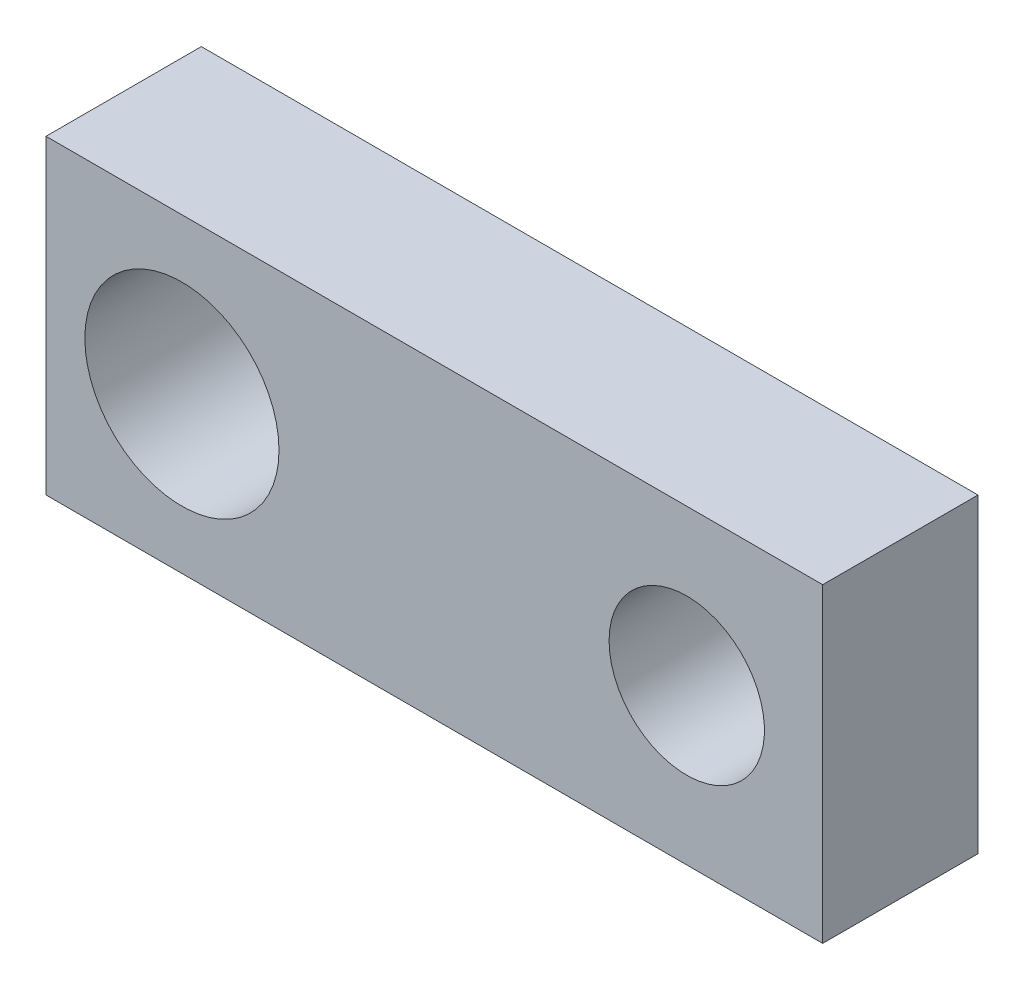
ISO-10303-21;
HEADER;
FILE_DESCRIPTION(('STEP AP214'),'2;1');
FILE_NAME('part.step','',(''),(''),'','','');
FILE_SCHEMA(('AUTOMOTIVE_DESIGN { 1 0 10303 214 1 1 1 1 }'));
ENDSEC;
DATA;
#1=APPLICATION_CONTEXT('core data for automotive mechanical design processes');
#2=APPLICATION_PROTOCOL_DEFINITION('international standard','automotive_design',2000,#1);
#3=PRODUCT_CONTEXT('',#1,'mechanical');
#4=PRODUCT('Part','Part','',(#3));
#5=PRODUCT_RELATED_PRODUCT_CATEGORY('part','',(#4));
#6=PRODUCT_DEFINITION_FORMATION('','',#4);
#7=PRODUCT_DEFINITION_CONTEXT('part definition',#1,'design');
#8=PRODUCT_DEFINITION('design','',#6,#7);
#9=PRODUCT_DEFINITION_SHAPE('','',#8);
#10=(LENGTH_UNIT() NAMED_UNIT(*) SI_UNIT(.MILLI.,.METRE.));
#11=(NAMED_UNIT(*) PLANE_ANGLE_UNIT() SI_UNIT($,.RADIAN.));
#12=(NAMED_UNIT(*) SI_UNIT($,.STERADIAN.) SOLID_ANGLE_UNIT());
#13=UNCERTAINTY_MEASURE_WITH_UNIT(LENGTH_MEASURE(1.E-05),#10,'distance_accuracy_value','');
#14=(GEOMETRIC_REPRESENTATION_CONTEXT(3) GLOBAL_UNCERTAINTY_ASSIGNED_CONTEXT((#13)) GLOBAL_UNIT_ASSIGNED_CONTEXT((#10,
#11,#12)) REPRESENTATION_CONTEXT('',''));
#15=CARTESIAN_POINT('',(0.,0.,0.));
#16=DIRECTION('',(0.,0.,1.));
#17=DIRECTION('',(1.,0.,0.));
#18=AXIS2_PLACEMENT_3D('',#15,#16,#17);
#19=CARTESIAN_POINT('',(0.,0.,4.));
#20=DIRECTION('',(0.,0.,-1.));
#21=DIRECTION('',(-1.,0.,0.));
#22=AXIS2_PLACEMENT_3D('',#19,#20,#21);
#23=PLANE('',#22);
#24=CARTESIAN_POINT('',(3.5,4.,4.));
#25=DIRECTION('',(0.,0.,1.));
#26=DIRECTION('',(1.,0.,0.));
#27=AXIS2_PLACEMENT_3D('',#24,#25,#26);
#28=CIRCLE('',#27,2.5);
#29=CARTESIAN_POINT('',(6.,4.,4.));
#30=VERTEX_POINT('',#29);
#31=EDGE_CURVE('E98',#30,#30,#28,.T.);
#32=ORIENTED_EDGE('',*,*,#31,.F.);
#33=EDGE_LOOP('',(#32));
#34=FACE_BOUND('',#33,.T.);
#35=DIRECTION('',(1.,0.,0.));
#36=VECTOR('',#35,1.);
#37=CARTESIAN_POINT('',(20.,0.,4.));
#38=LINE('',#37,#36);
#39=CARTESIAN_POINT('',(0.,0.,4.));
#40=VERTEX_POINT('',#39);
#41=CARTESIAN_POINT('',(20.,0.,4.));
#42=VERTEX_POINT('',#41);
#43=EDGE_CURVE('E83',#40,#42,#38,.T.);
#44=ORIENTED_EDGE('',*,*,#43,.T.);
#45=DIRECTION('',(0.,1.,0.));
#46=VECTOR('',#45,1.);
#47=CARTESIAN_POINT('',(20.,8.,4.));
#48=LINE('',#47,#46);
#49=CARTESIAN_POINT('',(20.,8.,4.));
#50=VERTEX_POINT('',#49);
#51=EDGE_CURVE('E78',#42,#50,#48,.T.);
#52=ORIENTED_EDGE('',*,*,#51,.T.);
#53=DIRECTION('',(-1.,0.,0.));
#54=VECTOR('',#53,1.);
#55=CARTESIAN_POINT('',(0.,8.,4.));
#56=LINE('',#55,#54);
#57=CARTESIAN_POINT('',(0.,8.,4.));
#58=VERTEX_POINT('',#57);
#59=EDGE_CURVE('E81',#50,#58,#56,.T.);
#60=ORIENTED_EDGE('',*,*,#59,.T.);
#61=DIRECTION('',(0.,-1.,0.));
#62=VECTOR('',#61,1.);
#63=CARTESIAN_POINT('',(0.,0.,4.));
#64=LINE('',#63,#62);
#65=EDGE_CURVE('E48',#58,#40,#64,.T.);
#66=ORIENTED_EDGE('',*,*,#65,.T.);
#67=EDGE_LOOP('',(#44,#52,#60,#66));
#68=FACE_BOUND('',#67,.T.);
#69=CARTESIAN_POINT('',(16.5,4.,4.));
#70=DIRECTION('',(0.,0.,1.));
#71=DIRECTION('',(-1.,0.,0.));
#72=AXIS2_PLACEMENT_3D('',#69,#70,#71);
#73=CIRCLE('',#72,2.);
#74=CARTESIAN_POINT('',(14.5,4.,4.));
#75=VERTEX_POINT('',#74);
#76=EDGE_CURVE('E113',#75,#75,#73,.T.);
#77=ORIENTED_EDGE('',*,*,#76,.F.);
#78=EDGE_LOOP('',(#77));
#79=FACE_BOUND('',#78,.T.);
#80=ADVANCED_FACE('F31',(#34,#68,#79),#23,.F.);
#81=CARTESIAN_POINT('',(0.,0.,0.));
#82=DIRECTION('',(0.,0.,-1.));
#83=DIRECTION('',(-1.,0.,0.));
#84=AXIS2_PLACEMENT_3D('',#81,#82,#83);
#85=PLANE('',#84);
#86=CARTESIAN_POINT('',(3.5,4.,0.));
#87=DIRECTION('',(0.,0.,1.));
#88=DIRECTION('',(1.,0.,0.));
#89=AXIS2_PLACEMENT_3D('',#86,#87,#88);
#90=CIRCLE('',#89,2.5);
#91=CARTESIAN_POINT('',(6.,4.,0.));
#92=VERTEX_POINT('',#91);
#93=EDGE_CURVE('E110',#92,#92,#90,.T.);
#94=ORIENTED_EDGE('',*,*,#93,.T.);
#95=EDGE_LOOP('',(#94));
#96=FACE_BOUND('',#95,.T.);
#97=DIRECTION('',(1.,0.,0.));
#98=VECTOR('',#97,1.);
#99=CARTESIAN_POINT('',(20.,0.,0.));
#100=LINE('',#99,#98);
#101=CARTESIAN_POINT('',(0.,0.,0.));
#102=VERTEX_POINT('',#101);
#103=CARTESIAN_POINT('',(20.,0.,0.));
#104=VERTEX_POINT('',#103);
#105=EDGE_CURVE('E95',#102,#104,#100,.T.);
#106=ORIENTED_EDGE('',*,*,#105,.F.);
#107=DIRECTION('',(0.,-1.,0.));
#108=VECTOR('',#107,1.);
#109=CARTESIAN_POINT('',(0.,0.,0.));
#110=LINE('',#109,#108);
#111=CARTESIAN_POINT('',(0.,8.,0.));
#112=VERTEX_POINT('',#111);
#113=EDGE_CURVE('E71',#112,#102,#110,.T.);
#114=ORIENTED_EDGE('',*,*,#113,.F.);
#115=DIRECTION('',(-1.,0.,0.));
#116=VECTOR('',#115,1.);
#117=CARTESIAN_POINT('',(0.,8.,0.));
#118=LINE('',#117,#116);
#119=CARTESIAN_POINT('',(20.,8.,0.));
#120=VERTEX_POINT('',#119);
#121=EDGE_CURVE('E65',#120,#112,#118,.T.);
#122=ORIENTED_EDGE('',*,*,#121,.F.);
#123=DIRECTION('',(0.,1.,0.));
#124=VECTOR('',#123,1.);
#125=CARTESIAN_POINT('',(20.,8.,0.));
#126=LINE('',#125,#124);
#127=EDGE_CURVE('E87',#104,#120,#126,.T.);
#128=ORIENTED_EDGE('',*,*,#127,.F.);
#129=EDGE_LOOP('',(#106,#114,#122,#128));
#130=FACE_BOUND('',#129,.T.);
#131=CARTESIAN_POINT('',(16.5,4.,0.));
#132=DIRECTION('',(0.,0.,1.));
#133=DIRECTION('',(-1.,0.,0.));
#134=AXIS2_PLACEMENT_3D('',#131,#132,#133);
#135=CIRCLE('',#134,2.);
#136=CARTESIAN_POINT('',(14.5,4.,0.));
#137=VERTEX_POINT('',#136);
#138=EDGE_CURVE('E116',#137,#137,#135,.T.);
#139=ORIENTED_EDGE('',*,*,#138,.T.);
#140=EDGE_LOOP('',(#139));
#141=FACE_BOUND('',#140,.T.);
#142=ADVANCED_FACE('F106',(#96,#130,#141),#85,.T.);
#143=CARTESIAN_POINT('',(20.,0.,4.));
#144=DIRECTION('',(0.,1.,0.));
#145=DIRECTION('',(0.,0.,1.));
#146=AXIS2_PLACEMENT_3D('',#143,#144,#145);
#147=PLANE('',#146);
#148=ORIENTED_EDGE('',*,*,#105,.T.);
#149=DIRECTION('',(0.,0.,-1.));
#150=VECTOR('',#149,1.);
#151=CARTESIAN_POINT('',(20.,0.,4.));
#152=LINE('',#151,#150);
#153=EDGE_CURVE('E11',#42,#104,#152,.T.);
#154=ORIENTED_EDGE('',*,*,#153,.F.);
#155=ORIENTED_EDGE('',*,*,#43,.F.);
#156=DIRECTION('',(0.,0.,-1.));
#157=VECTOR('',#156,1.);
#158=CARTESIAN_POINT('',(0.,0.,4.));
#159=LINE('',#158,#157);
#160=EDGE_CURVE('E91',#40,#102,#159,.T.);
#161=ORIENTED_EDGE('',*,*,#160,.T.);
#162=EDGE_LOOP('',(#148,#154,#155,#161));
#163=FACE_BOUND('',#162,.T.);
#164=ADVANCED_FACE('F33',(#163),#147,.F.);
#165=CARTESIAN_POINT('',(20.,8.,4.));
#166=DIRECTION('',(-1.,0.,0.));
#167=DIRECTION('',(0.,0.,1.));
#168=AXIS2_PLACEMENT_3D('',#165,#166,#167);
#169=PLANE('',#168);
#170=ORIENTED_EDGE('',*,*,#127,.T.);
#171=DIRECTION('',(0.,0.,-1.));
#172=VECTOR('',#171,1.);
#173=CARTESIAN_POINT('',(20.,8.,4.));
#174=LINE('',#173,#172);
#175=EDGE_CURVE('E40',#50,#120,#174,.T.);
#176=ORIENTED_EDGE('',*,*,#175,.F.);
#177=ORIENTED_EDGE('',*,*,#51,.F.);
#178=ORIENTED_EDGE('',*,*,#153,.T.);
#179=EDGE_LOOP('',(#170,#176,#177,#178));
#180=FACE_BOUND('',#179,.T.);
#181=ADVANCED_FACE('F86',(#180),#169,.F.);
#182=CARTESIAN_POINT('',(0.,8.,4.));
#183=DIRECTION('',(0.,-1.,0.));
#184=DIRECTION('',(0.,0.,-1.));
#185=AXIS2_PLACEMENT_3D('',#182,#183,#184);
#186=PLANE('',#185);
#187=ORIENTED_EDGE('',*,*,#121,.T.);
#188=DIRECTION('',(0.,0.,-1.));
#189=VECTOR('',#188,1.);
#190=CARTESIAN_POINT('',(0.,8.,4.));
#191=LINE('',#190,#189);
#192=EDGE_CURVE('E88',#58,#112,#191,.T.);
#193=ORIENTED_EDGE('',*,*,#192,.F.);
#194=ORIENTED_EDGE('',*,*,#59,.F.);
#195=ORIENTED_EDGE('',*,*,#175,.T.);
#196=EDGE_LOOP('',(#187,#193,#194,#195));
#197=FACE_BOUND('',#196,.T.);
#198=ADVANCED_FACE('F89',(#197),#186,.F.);
#199=CARTESIAN_POINT('',(0.,0.,4.));
#200=DIRECTION('',(1.,0.,0.));
#201=DIRECTION('',(0.,0.,-1.));
#202=AXIS2_PLACEMENT_3D('',#199,#200,#201);
#203=PLANE('',#202);
#204=ORIENTED_EDGE('',*,*,#113,.T.);
#205=ORIENTED_EDGE('',*,*,#160,.F.);
#206=ORIENTED_EDGE('',*,*,#65,.F.);
#207=ORIENTED_EDGE('',*,*,#192,.T.);
#208=EDGE_LOOP('',(#204,#205,#206,#207));
#209=FACE_BOUND('',#208,.T.);
#210=ADVANCED_FACE('F103',(#209),#203,.F.);
#211=CARTESIAN_POINT('',(3.5,4.,4.));
#212=DIRECTION('',(0.,0.,-1.));
#213=DIRECTION('',(-1.,0.,0.));
#214=AXIS2_PLACEMENT_3D('',#211,#212,#213);
#215=CYLINDRICAL_SURFACE('',#214,2.5);
#216=ORIENTED_EDGE('',*,*,#31,.T.);
#217=EDGE_LOOP('',(#216));
#218=FACE_BOUND('',#217,.T.);
#219=ORIENTED_EDGE('',*,*,#93,.F.);
#220=EDGE_LOOP('',(#219));
#221=FACE_BOUND('',#220,.T.);
#222=ADVANCED_FACE('F134',(#218,#221),#215,.F.);
#223=CARTESIAN_POINT('',(16.5,4.,4.));
#224=DIRECTION('',(0.,0.,-1.));
#225=DIRECTION('',(-1.,0.,0.));
#226=AXIS2_PLACEMENT_3D('',#223,#224,#225);
#227=CYLINDRICAL_SURFACE('',#226,2.);
#228=ORIENTED_EDGE('',*,*,#76,.T.);
#229=EDGE_LOOP('',(#228));
#230=FACE_BOUND('',#229,.T.);
#231=ORIENTED_EDGE('',*,*,#138,.F.);
#232=EDGE_LOOP('',(#231));
#233=FACE_BOUND('',#232,.T.);
#234=ADVANCED_FACE('F122',(#230,#233),#227,.F.);
#235=CLOSED_SHELL('',(#80,#142,#164,#181,#198,#210,#222,#234));
#236=MANIFOLD_SOLID_BREP('B2',#235);
#237=ADVANCED_BREP_SHAPE_REPRESENTATION('',(#18,#236),#14);
#238=SHAPE_DEFINITION_REPRESENTATION(#9,#237);
ENDSEC;
END-ISO-10303-21;
